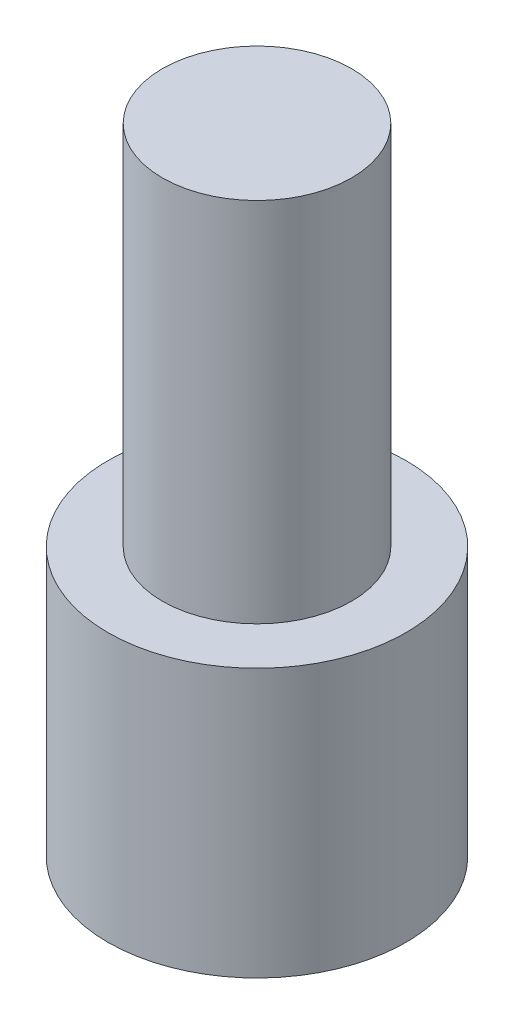
ISO-10303-21;
HEADER;
FILE_DESCRIPTION(('STEP AP214'),'2;1');
FILE_NAME('part.step','',(''),(''),'','','');
FILE_SCHEMA(('AUTOMOTIVE_DESIGN { 1 0 10303 214 1 1 1 1 }'));
ENDSEC;
DATA;
#1=APPLICATION_CONTEXT('core data for automotive mechanical design processes');
#2=APPLICATION_PROTOCOL_DEFINITION('international standard','automotive_design',2000,#1);
#3=PRODUCT_CONTEXT('',#1,'mechanical');
#4=PRODUCT('Part','Part','',(#3));
#5=PRODUCT_RELATED_PRODUCT_CATEGORY('part','',(#4));
#6=PRODUCT_DEFINITION_FORMATION('','',#4);
#7=PRODUCT_DEFINITION_CONTEXT('part definition',#1,'design');
#8=PRODUCT_DEFINITION('design','',#6,#7);
#9=PRODUCT_DEFINITION_SHAPE('','',#8);
#10=(LENGTH_UNIT() NAMED_UNIT(*) SI_UNIT(.MILLI.,.METRE.));
#11=(NAMED_UNIT(*) PLANE_ANGLE_UNIT() SI_UNIT($,.RADIAN.));
#12=(NAMED_UNIT(*) SI_UNIT($,.STERADIAN.) SOLID_ANGLE_UNIT());
#13=UNCERTAINTY_MEASURE_WITH_UNIT(LENGTH_MEASURE(1.E-05),#10,'distance_accuracy_value','');
#14=(GEOMETRIC_REPRESENTATION_CONTEXT(3) GLOBAL_UNCERTAINTY_ASSIGNED_CONTEXT((#13)) GLOBAL_UNIT_ASSIGNED_CONTEXT((#10,
#11,#12)) REPRESENTATION_CONTEXT('',''));
#15=CARTESIAN_POINT('',(0.,0.,0.));
#16=DIRECTION('',(0.,0.,1.));
#17=DIRECTION('',(1.,0.,0.));
#18=AXIS2_PLACEMENT_3D('',#15,#16,#17);
#19=CARTESIAN_POINT('',(0.,9.,0.));
#20=DIRECTION('',(0.,-1.,0.));
#21=DIRECTION('',(0.,0.,-1.));
#22=AXIS2_PLACEMENT_3D('',#19,#20,#21);
#23=CYLINDRICAL_SURFACE('',#22,5.);
#24=CARTESIAN_POINT('',(0.,9.,0.));
#25=DIRECTION('',(0.,1.,0.));
#26=DIRECTION('',(0.,0.,1.));
#27=AXIS2_PLACEMENT_3D('',#24,#25,#26);
#28=CIRCLE('',#27,5.);
#29=CARTESIAN_POINT('',(0.,9.,5.));
#30=VERTEX_POINT('',#29);
#31=EDGE_CURVE('E39',#30,#30,#28,.T.);
#32=ORIENTED_EDGE('',*,*,#31,.F.);
#33=EDGE_LOOP('',(#32));
#34=FACE_BOUND('',#33,.T.);
#35=CARTESIAN_POINT('',(0.,0.,0.));
#36=DIRECTION('',(0.,1.,0.));
#37=DIRECTION('',(0.,0.,1.));
#38=AXIS2_PLACEMENT_3D('',#35,#36,#37);
#39=CIRCLE('',#38,5.);
#40=CARTESIAN_POINT('',(0.,0.,5.));
#41=VERTEX_POINT('',#40);
#42=EDGE_CURVE('E35',#41,#41,#39,.T.);
#43=ORIENTED_EDGE('',*,*,#42,.T.);
#44=EDGE_LOOP('',(#43));
#45=FACE_BOUND('',#44,.T.);
#46=ADVANCED_FACE('F32',(#34,#45),#23,.T.);
#47=CARTESIAN_POINT('',(0.,9.,0.));
#48=DIRECTION('',(0.,1.,0.));
#49=DIRECTION('',(0.,0.,1.));
#50=AXIS2_PLACEMENT_3D('',#47,#48,#49);
#51=PLANE('',#50);
#52=CARTESIAN_POINT('',(0.,9.,0.));
#53=DIRECTION('',(0.,1.,0.));
#54=DIRECTION('',(0.,0.,1.));
#55=AXIS2_PLACEMENT_3D('',#52,#53,#54);
#56=CIRCLE('',#55,3.175);
#57=CARTESIAN_POINT('',(0.,9.,3.175));
#58=VERTEX_POINT('',#57);
#59=EDGE_CURVE('E10',#58,#58,#56,.T.);
#60=ORIENTED_EDGE('',*,*,#59,.F.);
#61=EDGE_LOOP('',(#60));
#62=FACE_BOUND('',#61,.T.);
#63=ORIENTED_EDGE('',*,*,#31,.T.);
#64=EDGE_LOOP('',(#63));
#65=FACE_BOUND('',#64,.T.);
#66=ADVANCED_FACE('F56',(#62,#65),#51,.T.);
#67=CARTESIAN_POINT('',(0.,0.,0.));
#68=DIRECTION('',(0.,1.,0.));
#69=DIRECTION('',(0.,0.,1.));
#70=AXIS2_PLACEMENT_3D('',#67,#68,#69);
#71=PLANE('',#70);
#72=ORIENTED_EDGE('',*,*,#42,.F.);
#73=EDGE_LOOP('',(#72));
#74=FACE_BOUND('',#73,.T.);
#75=ADVANCED_FACE('F53',(#74),#71,.F.);
#76=CARTESIAN_POINT('',(0.,21.3,0.));
#77=DIRECTION('',(0.,-1.,0.));
#78=DIRECTION('',(0.,0.,-1.));
#79=AXIS2_PLACEMENT_3D('',#76,#77,#78);
#80=CYLINDRICAL_SURFACE('',#79,3.175);
#81=CARTESIAN_POINT('',(0.,21.3,0.));
#82=DIRECTION('',(0.,1.,0.));
#83=DIRECTION('',(0.,0.,1.));
#84=AXIS2_PLACEMENT_3D('',#81,#82,#83);
#85=CIRCLE('',#84,3.175);
#86=CARTESIAN_POINT('',(0.,21.3,3.175));
#87=VERTEX_POINT('',#86);
#88=EDGE_CURVE('E45',#87,#87,#85,.T.);
#89=ORIENTED_EDGE('',*,*,#88,.F.);
#90=EDGE_LOOP('',(#89));
#91=FACE_BOUND('',#90,.T.);
#92=ORIENTED_EDGE('',*,*,#59,.T.);
#93=EDGE_LOOP('',(#92));
#94=FACE_BOUND('',#93,.T.);
#95=ADVANCED_FACE('F55',(#91,#94),#80,.T.);
#96=CARTESIAN_POINT('',(0.,21.3,0.));
#97=DIRECTION('',(0.,1.,0.));
#98=DIRECTION('',(0.,0.,1.));
#99=AXIS2_PLACEMENT_3D('',#96,#97,#98);
#100=PLANE('',#99);
#101=ORIENTED_EDGE('',*,*,#88,.T.);
#102=EDGE_LOOP('',(#101));
#103=FACE_BOUND('',#102,.T.);
#104=ADVANCED_FACE('F61',(#103),#100,.T.);
#105=CLOSED_SHELL('',(#46,#66,#75,#95,#104));
#106=MANIFOLD_SOLID_BREP('B2',#105);
#107=ADVANCED_BREP_SHAPE_REPRESENTATION('',(#18,#106),#14);
#108=SHAPE_DEFINITION_REPRESENTATION(#9,#107);
ENDSEC;
END-ISO-10303-21;
